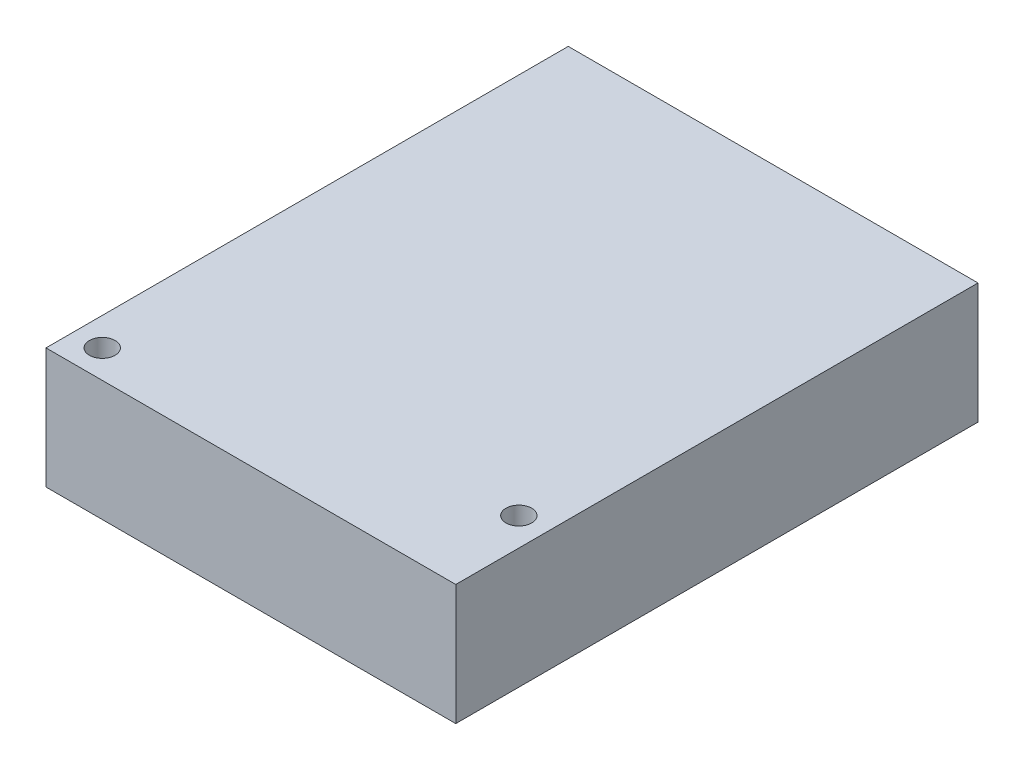
ISO-10303-21;
HEADER;
FILE_DESCRIPTION(('STEP AP214'),'2;1');
FILE_NAME('part.step','',(''),(''),'','','');
FILE_SCHEMA(('AUTOMOTIVE_DESIGN { 1 0 10303 214 1 1 1 1 }'));
ENDSEC;
DATA;
#1=APPLICATION_CONTEXT('core data for automotive mechanical design processes');
#2=APPLICATION_PROTOCOL_DEFINITION('international standard','automotive_design',2000,#1);
#3=PRODUCT_CONTEXT('',#1,'mechanical');
#4=PRODUCT('Part','Part','',(#3));
#5=PRODUCT_RELATED_PRODUCT_CATEGORY('part','',(#4));
#6=PRODUCT_DEFINITION_FORMATION('','',#4);
#7=PRODUCT_DEFINITION_CONTEXT('part definition',#1,'design');
#8=PRODUCT_DEFINITION('design','',#6,#7);
#9=PRODUCT_DEFINITION_SHAPE('','',#8);
#10=(LENGTH_UNIT() NAMED_UNIT(*) SI_UNIT(.MILLI.,.METRE.));
#11=(NAMED_UNIT(*) PLANE_ANGLE_UNIT() SI_UNIT($,.RADIAN.));
#12=(NAMED_UNIT(*) SI_UNIT($,.STERADIAN.) SOLID_ANGLE_UNIT());
#13=UNCERTAINTY_MEASURE_WITH_UNIT(LENGTH_MEASURE(1.E-05),#10,'distance_accuracy_value','');
#14=(GEOMETRIC_REPRESENTATION_CONTEXT(3) GLOBAL_UNCERTAINTY_ASSIGNED_CONTEXT((#13)) GLOBAL_UNIT_ASSIGNED_CONTEXT((#10,
#11,#12)) REPRESENTATION_CONTEXT('',''));
#15=CARTESIAN_POINT('',(0.,0.,0.));
#16=DIRECTION('',(0.,0.,1.));
#17=DIRECTION('',(1.,0.,0.));
#18=AXIS2_PLACEMENT_3D('',#15,#16,#17);
#19=CARTESIAN_POINT('',(0.,15.,0.));
#20=DIRECTION('',(0.,1.,0.));
#21=DIRECTION('',(0.,0.,1.));
#22=AXIS2_PLACEMENT_3D('',#19,#20,#21);
#23=PLANE('',#22);
#24=CARTESIAN_POINT('',(-22.,15.,29.));
#25=DIRECTION('',(0.,1.,0.));
#26=DIRECTION('',(0.,0.,1.));
#27=AXIS2_PLACEMENT_3D('',#24,#25,#26);
#28=CIRCLE('',#27,1.6);
#29=CARTESIAN_POINT('',(-22.,15.,30.6));
#30=VERTEX_POINT('',#29);
#31=EDGE_CURVE('E100',#30,#30,#28,.T.);
#32=ORIENTED_EDGE('',*,*,#31,.F.);
#33=EDGE_LOOP('',(#32));
#34=FACE_BOUND('',#33,.T.);
#35=DIRECTION('',(0.,0.,1.));
#36=VECTOR('',#35,1.);
#37=CARTESIAN_POINT('',(-25.5,15.,32.5));
#38=LINE('',#37,#36);
#39=CARTESIAN_POINT('',(-25.5,15.,-32.5));
#40=VERTEX_POINT('',#39);
#41=CARTESIAN_POINT('',(-25.5,15.,32.5));
#42=VERTEX_POINT('',#41);
#43=EDGE_CURVE('E85',#40,#42,#38,.T.);
#44=ORIENTED_EDGE('',*,*,#43,.T.);
#45=DIRECTION('',(1.,0.,0.));
#46=VECTOR('',#45,1.);
#47=CARTESIAN_POINT('',(25.5,15.,32.5));
#48=LINE('',#47,#46);
#49=CARTESIAN_POINT('',(25.5,15.,32.5));
#50=VERTEX_POINT('',#49);
#51=EDGE_CURVE('E80',#42,#50,#48,.T.);
#52=ORIENTED_EDGE('',*,*,#51,.T.);
#53=DIRECTION('',(0.,0.,-1.));
#54=VECTOR('',#53,1.);
#55=CARTESIAN_POINT('',(25.5,15.,32.5));
#56=LINE('',#55,#54);
#57=CARTESIAN_POINT('',(25.5,15.,-32.5));
#58=VERTEX_POINT('',#57);
#59=EDGE_CURVE('E83',#50,#58,#56,.T.);
#60=ORIENTED_EDGE('',*,*,#59,.T.);
#61=DIRECTION('',(-1.,0.,0.));
#62=VECTOR('',#61,1.);
#63=CARTESIAN_POINT('',(25.5,15.,-32.5));
#64=LINE('',#63,#62);
#65=EDGE_CURVE('E50',#58,#40,#64,.T.);
#66=ORIENTED_EDGE('',*,*,#65,.T.);
#67=EDGE_LOOP('',(#44,#52,#60,#66));
#68=FACE_BOUND('',#67,.T.);
#69=CARTESIAN_POINT('',(22.,15.,21.15));
#70=DIRECTION('',(0.,1.,0.));
#71=DIRECTION('',(0.,0.,1.));
#72=AXIS2_PLACEMENT_3D('',#69,#70,#71);
#73=CIRCLE('',#72,1.6);
#74=CARTESIAN_POINT('',(22.,15.,22.75));
#75=VERTEX_POINT('',#74);
#76=EDGE_CURVE('E115',#75,#75,#73,.T.);
#77=ORIENTED_EDGE('',*,*,#76,.F.);
#78=EDGE_LOOP('',(#77));
#79=FACE_BOUND('',#78,.T.);
#80=ADVANCED_FACE('F33',(#34,#68,#79),#23,.T.);
#81=CARTESIAN_POINT('',(0.,0.,0.));
#82=DIRECTION('',(0.,1.,0.));
#83=DIRECTION('',(0.,0.,1.));
#84=AXIS2_PLACEMENT_3D('',#81,#82,#83);
#85=PLANE('',#84);
#86=CARTESIAN_POINT('',(-22.,0.,29.));
#87=DIRECTION('',(0.,1.,0.));
#88=DIRECTION('',(0.,0.,1.));
#89=AXIS2_PLACEMENT_3D('',#86,#87,#88);
#90=CIRCLE('',#89,1.6);
#91=CARTESIAN_POINT('',(-22.,0.,30.6));
#92=VERTEX_POINT('',#91);
#93=EDGE_CURVE('E112',#92,#92,#90,.T.);
#94=ORIENTED_EDGE('',*,*,#93,.T.);
#95=EDGE_LOOP('',(#94));
#96=FACE_BOUND('',#95,.T.);
#97=DIRECTION('',(0.,0.,1.));
#98=VECTOR('',#97,1.);
#99=CARTESIAN_POINT('',(-25.5,0.,32.5));
#100=LINE('',#99,#98);
#101=CARTESIAN_POINT('',(-25.5,0.,-32.5));
#102=VERTEX_POINT('',#101);
#103=CARTESIAN_POINT('',(-25.5,0.,32.5));
#104=VERTEX_POINT('',#103);
#105=EDGE_CURVE('E97',#102,#104,#100,.T.);
#106=ORIENTED_EDGE('',*,*,#105,.F.);
#107=DIRECTION('',(-1.,0.,0.));
#108=VECTOR('',#107,1.);
#109=CARTESIAN_POINT('',(25.5,0.,-32.5));
#110=LINE('',#109,#108);
#111=CARTESIAN_POINT('',(25.5,0.,-32.5));
#112=VERTEX_POINT('',#111);
#113=EDGE_CURVE('E73',#112,#102,#110,.T.);
#114=ORIENTED_EDGE('',*,*,#113,.F.);
#115=DIRECTION('',(0.,0.,-1.));
#116=VECTOR('',#115,1.);
#117=CARTESIAN_POINT('',(25.5,0.,32.5));
#118=LINE('',#117,#116);
#119=CARTESIAN_POINT('',(25.5,0.,32.5));
#120=VERTEX_POINT('',#119);
#121=EDGE_CURVE('E67',#120,#112,#118,.T.);
#122=ORIENTED_EDGE('',*,*,#121,.F.);
#123=DIRECTION('',(1.,0.,0.));
#124=VECTOR('',#123,1.);
#125=CARTESIAN_POINT('',(25.5,0.,32.5));
#126=LINE('',#125,#124);
#127=EDGE_CURVE('E89',#104,#120,#126,.T.);
#128=ORIENTED_EDGE('',*,*,#127,.F.);
#129=EDGE_LOOP('',(#106,#114,#122,#128));
#130=FACE_BOUND('',#129,.T.);
#131=CARTESIAN_POINT('',(22.,0.,21.15));
#132=DIRECTION('',(0.,1.,0.));
#133=DIRECTION('',(0.,0.,1.));
#134=AXIS2_PLACEMENT_3D('',#131,#132,#133);
#135=CIRCLE('',#134,1.6);
#136=CARTESIAN_POINT('',(22.,0.,22.75));
#137=VERTEX_POINT('',#136);
#138=EDGE_CURVE('E118',#137,#137,#135,.T.);
#139=ORIENTED_EDGE('',*,*,#138,.T.);
#140=EDGE_LOOP('',(#139));
#141=FACE_BOUND('',#140,.T.);
#142=ADVANCED_FACE('F108',(#96,#130,#141),#85,.F.);
#143=CARTESIAN_POINT('',(-25.5,15.,32.5));
#144=DIRECTION('',(1.,0.,0.));
#145=DIRECTION('',(0.,0.,-1.));
#146=AXIS2_PLACEMENT_3D('',#143,#144,#145);
#147=PLANE('',#146);
#148=ORIENTED_EDGE('',*,*,#105,.T.);
#149=DIRECTION('',(0.,-1.,0.));
#150=VECTOR('',#149,1.);
#151=CARTESIAN_POINT('',(-25.5,15.,32.5));
#152=LINE('',#151,#150);
#153=EDGE_CURVE('E11',#42,#104,#152,.T.);
#154=ORIENTED_EDGE('',*,*,#153,.F.);
#155=ORIENTED_EDGE('',*,*,#43,.F.);
#156=DIRECTION('',(0.,-1.,0.));
#157=VECTOR('',#156,1.);
#158=CARTESIAN_POINT('',(-25.5,15.,-32.5));
#159=LINE('',#158,#157);
#160=EDGE_CURVE('E93',#40,#102,#159,.T.);
#161=ORIENTED_EDGE('',*,*,#160,.T.);
#162=EDGE_LOOP('',(#148,#154,#155,#161));
#163=FACE_BOUND('',#162,.T.);
#164=ADVANCED_FACE('F35',(#163),#147,.F.);
#165=CARTESIAN_POINT('',(25.5,15.,32.5));
#166=DIRECTION('',(0.,0.,-1.));
#167=DIRECTION('',(-1.,0.,0.));
#168=AXIS2_PLACEMENT_3D('',#165,#166,#167);
#169=PLANE('',#168);
#170=ORIENTED_EDGE('',*,*,#127,.T.);
#171=DIRECTION('',(0.,-1.,0.));
#172=VECTOR('',#171,1.);
#173=CARTESIAN_POINT('',(25.5,15.,32.5));
#174=LINE('',#173,#172);
#175=EDGE_CURVE('E42',#50,#120,#174,.T.);
#176=ORIENTED_EDGE('',*,*,#175,.F.);
#177=ORIENTED_EDGE('',*,*,#51,.F.);
#178=ORIENTED_EDGE('',*,*,#153,.T.);
#179=EDGE_LOOP('',(#170,#176,#177,#178));
#180=FACE_BOUND('',#179,.T.);
#181=ADVANCED_FACE('F88',(#180),#169,.F.);
#182=CARTESIAN_POINT('',(25.5,15.,32.5));
#183=DIRECTION('',(-1.,0.,0.));
#184=DIRECTION('',(0.,0.,1.));
#185=AXIS2_PLACEMENT_3D('',#182,#183,#184);
#186=PLANE('',#185);
#187=ORIENTED_EDGE('',*,*,#121,.T.);
#188=DIRECTION('',(0.,-1.,0.));
#189=VECTOR('',#188,1.);
#190=CARTESIAN_POINT('',(25.5,15.,-32.5));
#191=LINE('',#190,#189);
#192=EDGE_CURVE('E90',#58,#112,#191,.T.);
#193=ORIENTED_EDGE('',*,*,#192,.F.);
#194=ORIENTED_EDGE('',*,*,#59,.F.);
#195=ORIENTED_EDGE('',*,*,#175,.T.);
#196=EDGE_LOOP('',(#187,#193,#194,#195));
#197=FACE_BOUND('',#196,.T.);
#198=ADVANCED_FACE('F91',(#197),#186,.F.);
#199=CARTESIAN_POINT('',(25.5,15.,-32.5));
#200=DIRECTION('',(0.,0.,1.));
#201=DIRECTION('',(1.,0.,0.));
#202=AXIS2_PLACEMENT_3D('',#199,#200,#201);
#203=PLANE('',#202);
#204=ORIENTED_EDGE('',*,*,#113,.T.);
#205=ORIENTED_EDGE('',*,*,#160,.F.);
#206=ORIENTED_EDGE('',*,*,#65,.F.);
#207=ORIENTED_EDGE('',*,*,#192,.T.);
#208=EDGE_LOOP('',(#204,#205,#206,#207));
#209=FACE_BOUND('',#208,.T.);
#210=ADVANCED_FACE('F105',(#209),#203,.F.);
#211=CARTESIAN_POINT('',(-22.,15.,29.));
#212=DIRECTION('',(0.,-1.,0.));
#213=DIRECTION('',(0.,0.,-1.));
#214=AXIS2_PLACEMENT_3D('',#211,#212,#213);
#215=CYLINDRICAL_SURFACE('',#214,1.6);
#216=ORIENTED_EDGE('',*,*,#31,.T.);
#217=EDGE_LOOP('',(#216));
#218=FACE_BOUND('',#217,.T.);
#219=ORIENTED_EDGE('',*,*,#93,.F.);
#220=EDGE_LOOP('',(#219));
#221=FACE_BOUND('',#220,.T.);
#222=ADVANCED_FACE('F136',(#218,#221),#215,.F.);
#223=CARTESIAN_POINT('',(22.,15.,21.15));
#224=DIRECTION('',(0.,-1.,0.));
#225=DIRECTION('',(0.,0.,-1.));
#226=AXIS2_PLACEMENT_3D('',#223,#224,#225);
#227=CYLINDRICAL_SURFACE('',#226,1.6);
#228=ORIENTED_EDGE('',*,*,#76,.T.);
#229=EDGE_LOOP('',(#228));
#230=FACE_BOUND('',#229,.T.);
#231=ORIENTED_EDGE('',*,*,#138,.F.);
#232=EDGE_LOOP('',(#231));
#233=FACE_BOUND('',#232,.T.);
#234=ADVANCED_FACE('F124',(#230,#233),#227,.F.);
#235=CLOSED_SHELL('',(#80,#142,#164,#181,#198,#210,#222,#234));
#236=MANIFOLD_SOLID_BREP('B2',#235);
#237=ADVANCED_BREP_SHAPE_REPRESENTATION('',(#18,#236),#14);
#238=SHAPE_DEFINITION_REPRESENTATION(#9,#237);
ENDSEC;
END-ISO-10303-21;
